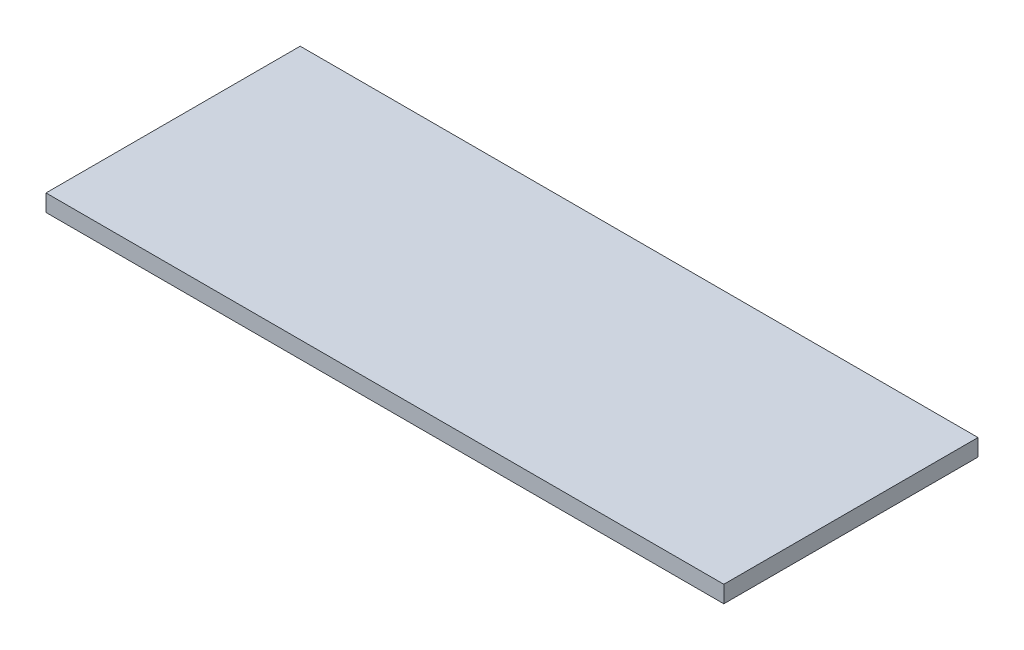
ISO-10303-21;
HEADER;
FILE_DESCRIPTION(('STEP AP214'),'2;1');
FILE_NAME('part.step','',(''),(''),'','','');
FILE_SCHEMA(('AUTOMOTIVE_DESIGN { 1 0 10303 214 1 1 1 1 }'));
ENDSEC;
DATA;
#1=APPLICATION_CONTEXT('core data for automotive mechanical design processes');
#2=APPLICATION_PROTOCOL_DEFINITION('international standard','automotive_design',2000,#1);
#3=PRODUCT_CONTEXT('',#1,'mechanical');
#4=PRODUCT('Part','Part','',(#3));
#5=PRODUCT_RELATED_PRODUCT_CATEGORY('part','',(#4));
#6=PRODUCT_DEFINITION_FORMATION('','',#4);
#7=PRODUCT_DEFINITION_CONTEXT('part definition',#1,'design');
#8=PRODUCT_DEFINITION('design','',#6,#7);
#9=PRODUCT_DEFINITION_SHAPE('','',#8);
#10=(LENGTH_UNIT() NAMED_UNIT(*) SI_UNIT(.MILLI.,.METRE.));
#11=(NAMED_UNIT(*) PLANE_ANGLE_UNIT() SI_UNIT($,.RADIAN.));
#12=(NAMED_UNIT(*) SI_UNIT($,.STERADIAN.) SOLID_ANGLE_UNIT());
#13=UNCERTAINTY_MEASURE_WITH_UNIT(LENGTH_MEASURE(1.E-05),#10,'distance_accuracy_value','');
#14=(GEOMETRIC_REPRESENTATION_CONTEXT(3) GLOBAL_UNCERTAINTY_ASSIGNED_CONTEXT((#13)) GLOBAL_UNIT_ASSIGNED_CONTEXT((#10,
#11,#12)) REPRESENTATION_CONTEXT('',''));
#15=CARTESIAN_POINT('',(0.,0.,0.));
#16=DIRECTION('',(0.,0.,1.));
#17=DIRECTION('',(1.,0.,0.));
#18=AXIS2_PLACEMENT_3D('',#15,#16,#17);
#19=CARTESIAN_POINT('',(-4000.,100.,-1500.));
#20=DIRECTION('',(1.,0.,0.));
#21=DIRECTION('',(0.,0.,-1.));
#22=AXIS2_PLACEMENT_3D('',#19,#20,#21);
#23=PLANE('',#22);
#24=DIRECTION('',(0.,0.,1.));
#25=VECTOR('',#24,1.);
#26=CARTESIAN_POINT('',(-4000.,-100.,-1500.));
#27=LINE('',#26,#25);
#28=CARTESIAN_POINT('',(-4000.,-100.,-1500.));
#29=VERTEX_POINT('',#28);
#30=CARTESIAN_POINT('',(-4000.,-100.,1500.));
#31=VERTEX_POINT('',#30);
#32=EDGE_CURVE('E107',#29,#31,#27,.T.);
#33=ORIENTED_EDGE('',*,*,#32,.T.);
#34=DIRECTION('',(0.,-1.,0.));
#35=VECTOR('',#34,1.);
#36=CARTESIAN_POINT('',(-4000.,100.,1500.));
#37=LINE('',#36,#35);
#38=CARTESIAN_POINT('',(-4000.,100.,1500.));
#39=VERTEX_POINT('',#38);
#40=EDGE_CURVE('E11',#39,#31,#37,.T.);
#41=ORIENTED_EDGE('',*,*,#40,.F.);
#42=DIRECTION('',(0.,0.,1.));
#43=VECTOR('',#42,1.);
#44=CARTESIAN_POINT('',(-4000.,100.,-1500.));
#45=LINE('',#44,#43);
#46=CARTESIAN_POINT('',(-4000.,100.,-1500.));
#47=VERTEX_POINT('',#46);
#48=EDGE_CURVE('E91',#47,#39,#45,.T.);
#49=ORIENTED_EDGE('',*,*,#48,.F.);
#50=DIRECTION('',(0.,-1.,0.));
#51=VECTOR('',#50,1.);
#52=CARTESIAN_POINT('',(-4000.,100.,-1500.));
#53=LINE('',#52,#51);
#54=EDGE_CURVE('E103',#47,#29,#53,.T.);
#55=ORIENTED_EDGE('',*,*,#54,.T.);
#56=EDGE_LOOP('',(#33,#41,#49,#55));
#57=FACE_BOUND('',#56,.T.);
#58=ADVANCED_FACE('F39',(#57),#23,.F.);
#59=CARTESIAN_POINT('',(4000.,100.,1500.));
#60=DIRECTION('',(0.,0.,-1.));
#61=DIRECTION('',(-1.,0.,0.));
#62=AXIS2_PLACEMENT_3D('',#59,#60,#61);
#63=PLANE('',#62);
#64=DIRECTION('',(1.,0.,0.));
#65=VECTOR('',#64,1.);
#66=CARTESIAN_POINT('',(4000.,-100.,1500.));
#67=LINE('',#66,#65);
#68=CARTESIAN_POINT('',(4000.,-100.,1500.));
#69=VERTEX_POINT('',#68);
#70=EDGE_CURVE('E96',#31,#69,#67,.T.);
#71=ORIENTED_EDGE('',*,*,#70,.T.);
#72=DIRECTION('',(0.,-1.,0.));
#73=VECTOR('',#72,1.);
#74=CARTESIAN_POINT('',(4000.,100.,1500.));
#75=LINE('',#74,#73);
#76=CARTESIAN_POINT('',(4000.,100.,1500.));
#77=VERTEX_POINT('',#76);
#78=EDGE_CURVE('E48',#77,#69,#75,.T.);
#79=ORIENTED_EDGE('',*,*,#78,.F.);
#80=DIRECTION('',(1.,0.,0.));
#81=VECTOR('',#80,1.);
#82=CARTESIAN_POINT('',(4000.,100.,1500.));
#83=LINE('',#82,#81);
#84=EDGE_CURVE('E86',#39,#77,#83,.T.);
#85=ORIENTED_EDGE('',*,*,#84,.F.);
#86=ORIENTED_EDGE('',*,*,#40,.T.);
#87=EDGE_LOOP('',(#71,#79,#85,#86));
#88=FACE_BOUND('',#87,.T.);
#89=ADVANCED_FACE('F95',(#88),#63,.F.);
#90=CARTESIAN_POINT('',(4000.,100.,-1500.));
#91=DIRECTION('',(-1.,0.,0.));
#92=DIRECTION('',(0.,0.,1.));
#93=AXIS2_PLACEMENT_3D('',#90,#91,#92);
#94=PLANE('',#93);
#95=DIRECTION('',(0.,0.,-1.));
#96=VECTOR('',#95,1.);
#97=CARTESIAN_POINT('',(4000.,-100.,-1500.));
#98=LINE('',#97,#96);
#99=CARTESIAN_POINT('',(4000.,-100.,-1500.));
#100=VERTEX_POINT('',#99);
#101=EDGE_CURVE('E73',#69,#100,#98,.T.);
#102=ORIENTED_EDGE('',*,*,#101,.T.);
#103=DIRECTION('',(0.,-1.,0.));
#104=VECTOR('',#103,1.);
#105=CARTESIAN_POINT('',(4000.,100.,-1500.));
#106=LINE('',#105,#104);
#107=CARTESIAN_POINT('',(4000.,100.,-1500.));
#108=VERTEX_POINT('',#107);
#109=EDGE_CURVE('E98',#108,#100,#106,.T.);
#110=ORIENTED_EDGE('',*,*,#109,.F.);
#111=DIRECTION('',(0.,0.,-1.));
#112=VECTOR('',#111,1.);
#113=CARTESIAN_POINT('',(4000.,100.,-1500.));
#114=LINE('',#113,#112);
#115=EDGE_CURVE('E89',#77,#108,#114,.T.);
#116=ORIENTED_EDGE('',*,*,#115,.F.);
#117=ORIENTED_EDGE('',*,*,#78,.T.);
#118=EDGE_LOOP('',(#102,#110,#116,#117));
#119=FACE_BOUND('',#118,.T.);
#120=ADVANCED_FACE('F99',(#119),#94,.F.);
#121=CARTESIAN_POINT('',(4000.,100.,-1500.));
#122=DIRECTION('',(0.,0.,1.));
#123=DIRECTION('',(1.,0.,0.));
#124=AXIS2_PLACEMENT_3D('',#121,#122,#123);
#125=PLANE('',#124);
#126=DIRECTION('',(-1.,0.,0.));
#127=VECTOR('',#126,1.);
#128=CARTESIAN_POINT('',(4000.,-100.,-1500.));
#129=LINE('',#128,#127);
#130=EDGE_CURVE('E79',#100,#29,#129,.T.);
#131=ORIENTED_EDGE('',*,*,#130,.T.);
#132=ORIENTED_EDGE('',*,*,#54,.F.);
#133=DIRECTION('',(-1.,0.,0.));
#134=VECTOR('',#133,1.);
#135=CARTESIAN_POINT('',(4000.,100.,-1500.));
#136=LINE('',#135,#134);
#137=EDGE_CURVE('E56',#108,#47,#136,.T.);
#138=ORIENTED_EDGE('',*,*,#137,.F.);
#139=ORIENTED_EDGE('',*,*,#109,.T.);
#140=EDGE_LOOP('',(#131,#132,#138,#139));
#141=FACE_BOUND('',#140,.T.);
#142=ADVANCED_FACE('F120',(#141),#125,.F.);
#143=CARTESIAN_POINT('',(0.,100.,0.));
#144=DIRECTION('',(0.,-1.,0.));
#145=DIRECTION('',(0.,0.,-1.));
#146=AXIS2_PLACEMENT_3D('',#143,#144,#145);
#147=PLANE('',#146);
#148=ORIENTED_EDGE('',*,*,#48,.T.);
#149=ORIENTED_EDGE('',*,*,#84,.T.);
#150=ORIENTED_EDGE('',*,*,#115,.T.);
#151=ORIENTED_EDGE('',*,*,#137,.T.);
#152=EDGE_LOOP('',(#148,#149,#150,#151));
#153=FACE_BOUND('',#152,.T.);
#154=ADVANCED_FACE('F87',(#153),#147,.F.);
#155=CARTESIAN_POINT('',(0.,-100.,0.));
#156=DIRECTION('',(0.,-1.,0.));
#157=DIRECTION('',(0.,0.,-1.));
#158=AXIS2_PLACEMENT_3D('',#155,#156,#157);
#159=PLANE('',#158);
#160=ORIENTED_EDGE('',*,*,#32,.F.);
#161=ORIENTED_EDGE('',*,*,#130,.F.);
#162=ORIENTED_EDGE('',*,*,#101,.F.);
#163=ORIENTED_EDGE('',*,*,#70,.F.);
#164=EDGE_LOOP('',(#160,#161,#162,#163));
#165=FACE_BOUND('',#164,.T.);
#166=ADVANCED_FACE('F123',(#165),#159,.T.);
#167=CLOSED_SHELL('',(#58,#89,#120,#142,#154,#166));
#168=MANIFOLD_SOLID_BREP('B2',#167);
#169=ADVANCED_BREP_SHAPE_REPRESENTATION('',(#18,#168),#14);
#170=SHAPE_DEFINITION_REPRESENTATION(#9,#169);
ENDSEC;
END-ISO-10303-21;
